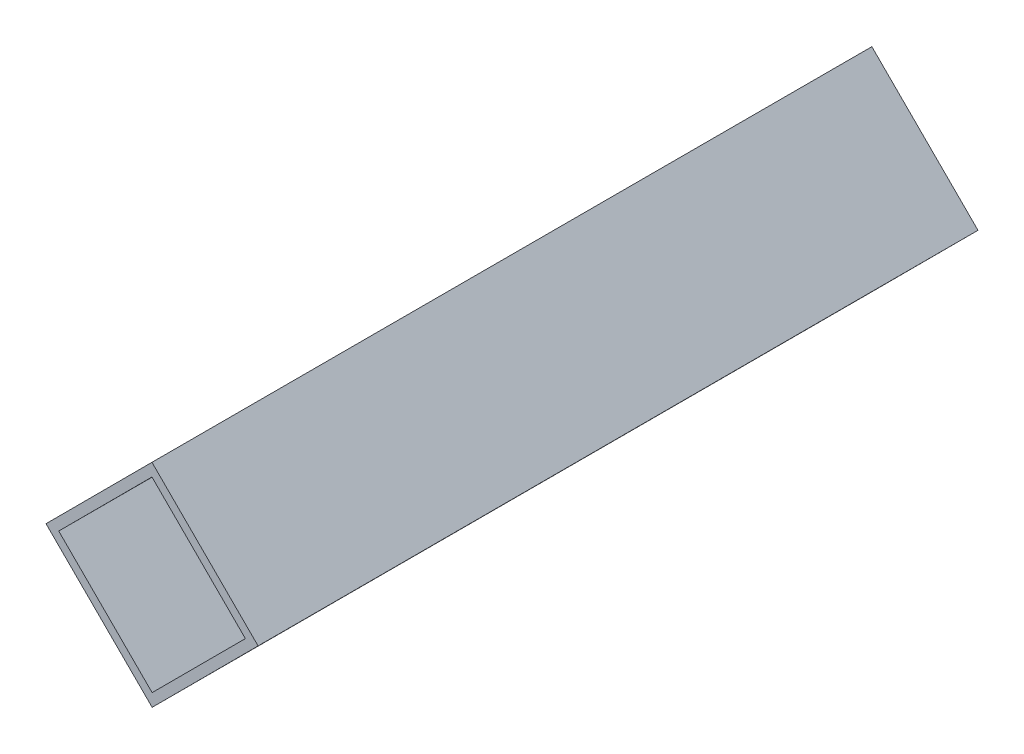
ISO-10303-21;
HEADER;
FILE_DESCRIPTION(('STEP AP214'),'2;1');
FILE_NAME('part.step','',(''),(''),'','','');
FILE_SCHEMA(('AUTOMOTIVE_DESIGN { 1 0 10303 214 1 1 1 1 }'));
ENDSEC;
DATA;
#1=APPLICATION_CONTEXT('core data for automotive mechanical design processes');
#2=APPLICATION_PROTOCOL_DEFINITION('international standard','automotive_design',2000,#1);
#3=PRODUCT_CONTEXT('',#1,'mechanical');
#4=PRODUCT('Part','Part','',(#3));
#5=PRODUCT_RELATED_PRODUCT_CATEGORY('part','',(#4));
#6=PRODUCT_DEFINITION_FORMATION('','',#4);
#7=PRODUCT_DEFINITION_CONTEXT('part definition',#1,'design');
#8=PRODUCT_DEFINITION('design','',#6,#7);
#9=PRODUCT_DEFINITION_SHAPE('','',#8);
#10=(LENGTH_UNIT() NAMED_UNIT(*) SI_UNIT(.MILLI.,.METRE.));
#11=(NAMED_UNIT(*) PLANE_ANGLE_UNIT() SI_UNIT($,.RADIAN.));
#12=(NAMED_UNIT(*) SI_UNIT($,.STERADIAN.) SOLID_ANGLE_UNIT());
#13=UNCERTAINTY_MEASURE_WITH_UNIT(LENGTH_MEASURE(1.E-05),#10,'distance_accuracy_value','');
#14=(GEOMETRIC_REPRESENTATION_CONTEXT(3) GLOBAL_UNCERTAINTY_ASSIGNED_CONTEXT((#13)) GLOBAL_UNIT_ASSIGNED_CONTEXT((#10,
#11,#12)) REPRESENTATION_CONTEXT('',''));
#15=CARTESIAN_POINT('',(0.,0.,0.));
#16=DIRECTION('',(0.,0.,1.));
#17=DIRECTION('',(1.,0.,0.));
#18=AXIS2_PLACEMENT_3D('',#15,#16,#17);
#19=CARTESIAN_POINT('',(0.,0.,120.));
#20=DIRECTION('',(0.,0.,1.));
#21=DIRECTION('',(1.,0.,0.));
#22=AXIS2_PLACEMENT_3D('',#19,#20,#21);
#23=PLANE('',#22);
#24=DIRECTION('',(-0.70646122875546,-0.707751744798503,0.));
#25=VECTOR('',#24,1.);
#26=CARTESIAN_POINT('',(0.,0.,120.));
#27=LINE('',#26,#25);
#28=CARTESIAN_POINT('',(0.,0.,120.));
#29=VERTEX_POINT('',#28);
#30=CARTESIAN_POINT('',(-17.6615307188865,-17.6937936199626,120.));
#31=VERTEX_POINT('',#30);
#32=EDGE_CURVE('E153',#29,#31,#27,.T.);
#33=ORIENTED_EDGE('',*,*,#32,.T.);
#34=DIRECTION('',(0.707751744798503,-0.70646122875546,0.));
#35=VECTOR('',#34,1.);
#36=CARTESIAN_POINT('',(-17.6615307188865,-17.6937936199626,120.));
#37=LINE('',#36,#35);
#38=CARTESIAN_POINT('',(0.0322629010760627,-35.3553243388491,120.));
#39=VERTEX_POINT('',#38);
#40=EDGE_CURVE('E157',#31,#39,#37,.T.);
#41=ORIENTED_EDGE('',*,*,#40,.T.);
#42=DIRECTION('',(0.70646122875546,0.707751744798503,0.));
#43=VECTOR('',#42,1.);
#44=CARTESIAN_POINT('',(17.6937936199626,-17.6615307188865,120.));
#45=LINE('',#44,#43);
#46=CARTESIAN_POINT('',(17.6937936199626,-17.6615307188865,120.));
#47=VERTEX_POINT('',#46);
#48=EDGE_CURVE('E161',#39,#47,#45,.T.);
#49=ORIENTED_EDGE('',*,*,#48,.T.);
#50=DIRECTION('',(-0.707751744798503,0.70646122875546,0.));
#51=VECTOR('',#50,1.);
#52=CARTESIAN_POINT('',(0.,0.,120.));
#53=LINE('',#52,#51);
#54=EDGE_CURVE('E164',#47,#29,#53,.T.);
#55=ORIENTED_EDGE('',*,*,#54,.T.);
#56=EDGE_LOOP('',(#33,#41,#49,#55));
#57=FACE_BOUND('',#56,.T.);
#58=DIRECTION('',(-0.706461228755461,-0.707751744798503,0.));
#59=VECTOR('',#58,1.);
#60=CARTESIAN_POINT('',(0.00193577406456353,-2.12131946033095,120.));
#61=LINE('',#60,#59);
#62=CARTESIAN_POINT('',(0.00193577406456353,-2.12131946033095,120.));
#63=VERTEX_POINT('',#62);
#64=CARTESIAN_POINT('',(-15.5402112585556,-17.691857845898,120.));
#65=VERTEX_POINT('',#64);
#66=EDGE_CURVE('E114',#63,#65,#61,.T.);
#67=ORIENTED_EDGE('',*,*,#66,.F.);
#68=DIRECTION('',(-0.707751744798503,0.70646122875546,0.));
#69=VECTOR('',#68,1.);
#70=CARTESIAN_POINT('',(0.00193577406456353,-2.12131946033095,120.));
#71=LINE('',#70,#69);
#72=CARTESIAN_POINT('',(15.5724741596316,-17.6634664929511,120.));
#73=VERTEX_POINT('',#72);
#74=EDGE_CURVE('E105',#73,#63,#71,.T.);
#75=ORIENTED_EDGE('',*,*,#74,.F.);
#76=DIRECTION('',(0.70646122875546,0.707751744798503,0.));
#77=VECTOR('',#76,1.);
#78=CARTESIAN_POINT('',(15.5724741596316,-17.6634664929511,120.));
#79=LINE('',#78,#77);
#80=CARTESIAN_POINT('',(0.0303271270114952,-33.2340048785181,120.));
#81=VERTEX_POINT('',#80);
#82=EDGE_CURVE('E131',#81,#73,#79,.T.);
#83=ORIENTED_EDGE('',*,*,#82,.F.);
#84=DIRECTION('',(0.707751744798503,-0.70646122875546,0.));
#85=VECTOR('',#84,1.);
#86=CARTESIAN_POINT('',(-15.5402112585556,-17.691857845898,120.));
#87=LINE('',#86,#85);
#88=EDGE_CURVE('E127',#65,#81,#87,.T.);
#89=ORIENTED_EDGE('',*,*,#88,.F.);
#90=EDGE_LOOP('',(#67,#75,#83,#89));
#91=FACE_BOUND('',#90,.T.);
#92=ADVANCED_FACE('F39',(#57,#91),#23,.T.);
#93=CARTESIAN_POINT('',(0.,0.,0.));
#94=DIRECTION('',(0.,0.,1.));
#95=DIRECTION('',(1.,0.,0.));
#96=AXIS2_PLACEMENT_3D('',#93,#94,#95);
#97=PLANE('',#96);
#98=DIRECTION('',(-0.70646122875546,-0.707751744798503,0.));
#99=VECTOR('',#98,1.);
#100=CARTESIAN_POINT('',(0.,0.,0.));
#101=LINE('',#100,#99);
#102=CARTESIAN_POINT('',(0.,0.,0.));
#103=VERTEX_POINT('',#102);
#104=CARTESIAN_POINT('',(-17.6615307188865,-17.6937936199626,0.));
#105=VERTEX_POINT('',#104);
#106=EDGE_CURVE('E123',#103,#105,#101,.T.);
#107=ORIENTED_EDGE('',*,*,#106,.F.);
#108=DIRECTION('',(-0.707751744798503,0.70646122875546,0.));
#109=VECTOR('',#108,1.);
#110=CARTESIAN_POINT('',(0.,0.,0.));
#111=LINE('',#110,#109);
#112=CARTESIAN_POINT('',(17.6937936199626,-17.6615307188865,0.));
#113=VERTEX_POINT('',#112);
#114=EDGE_CURVE('E158',#113,#103,#111,.T.);
#115=ORIENTED_EDGE('',*,*,#114,.F.);
#116=DIRECTION('',(0.70646122875546,0.707751744798503,0.));
#117=VECTOR('',#116,1.);
#118=CARTESIAN_POINT('',(17.6937936199626,-17.6615307188865,0.));
#119=LINE('',#118,#117);
#120=CARTESIAN_POINT('',(0.0322629010760627,-35.3553243388491,0.));
#121=VERTEX_POINT('',#120);
#122=EDGE_CURVE('E174',#121,#113,#119,.T.);
#123=ORIENTED_EDGE('',*,*,#122,.F.);
#124=DIRECTION('',(0.707751744798503,-0.70646122875546,0.));
#125=VECTOR('',#124,1.);
#126=CARTESIAN_POINT('',(-17.6615307188865,-17.6937936199626,0.));
#127=LINE('',#126,#125);
#128=EDGE_CURVE('E171',#105,#121,#127,.T.);
#129=ORIENTED_EDGE('',*,*,#128,.F.);
#130=EDGE_LOOP('',(#107,#115,#123,#129));
#131=FACE_BOUND('',#130,.T.);
#132=DIRECTION('',(-0.707751744798503,0.70646122875546,0.));
#133=VECTOR('',#132,1.);
#134=CARTESIAN_POINT('',(0.00193577406456353,-2.12131946033095,0.));
#135=LINE('',#134,#133);
#136=CARTESIAN_POINT('',(15.5724741596316,-17.6634664929511,0.));
#137=VERTEX_POINT('',#136);
#138=CARTESIAN_POINT('',(0.00193577406456353,-2.12131946033095,0.));
#139=VERTEX_POINT('',#138);
#140=EDGE_CURVE('E63',#137,#139,#135,.T.);
#141=ORIENTED_EDGE('',*,*,#140,.T.);
#142=DIRECTION('',(-0.706461228755461,-0.707751744798503,0.));
#143=VECTOR('',#142,1.);
#144=CARTESIAN_POINT('',(0.00193577406456353,-2.12131946033095,0.));
#145=LINE('',#144,#143);
#146=CARTESIAN_POINT('',(-15.5402112585556,-17.691857845898,0.));
#147=VERTEX_POINT('',#146);
#148=EDGE_CURVE('E121',#139,#147,#145,.T.);
#149=ORIENTED_EDGE('',*,*,#148,.T.);
#150=DIRECTION('',(0.707751744798503,-0.70646122875546,0.));
#151=VECTOR('',#150,1.);
#152=CARTESIAN_POINT('',(-15.5402112585556,-17.691857845898,0.));
#153=LINE('',#152,#151);
#154=CARTESIAN_POINT('',(0.0303271270114987,-33.2340048785181,0.));
#155=VERTEX_POINT('',#154);
#156=EDGE_CURVE('E140',#147,#155,#153,.T.);
#157=ORIENTED_EDGE('',*,*,#156,.T.);
#158=DIRECTION('',(0.70646122875546,0.707751744798503,0.));
#159=VECTOR('',#158,1.);
#160=CARTESIAN_POINT('',(15.5724741596316,-17.6634664929511,0.));
#161=LINE('',#160,#159);
#162=EDGE_CURVE('E115',#155,#137,#161,.T.);
#163=ORIENTED_EDGE('',*,*,#162,.T.);
#164=EDGE_LOOP('',(#141,#149,#157,#163));
#165=FACE_BOUND('',#164,.T.);
#166=ADVANCED_FACE('F197',(#131,#165),#97,.F.);
#167=CARTESIAN_POINT('',(0.,0.,120.));
#168=DIRECTION('',(0.707751744798503,-0.70646122875546,0.));
#169=DIRECTION('',(0.70646122875546,0.707751744798503,0.));
#170=AXIS2_PLACEMENT_3D('',#167,#168,#169);
#171=PLANE('',#170);
#172=ORIENTED_EDGE('',*,*,#106,.T.);
#173=DIRECTION('',(0.,0.,-1.));
#174=VECTOR('',#173,1.);
#175=CARTESIAN_POINT('',(-17.6615307188865,-17.6937936199626,120.));
#176=LINE('',#175,#174);
#177=EDGE_CURVE('E11',#31,#105,#176,.T.);
#178=ORIENTED_EDGE('',*,*,#177,.F.);
#179=ORIENTED_EDGE('',*,*,#32,.F.);
#180=DIRECTION('',(0.,0.,-1.));
#181=VECTOR('',#180,1.);
#182=CARTESIAN_POINT('',(0.,0.,120.));
#183=LINE('',#182,#181);
#184=EDGE_CURVE('E167',#29,#103,#183,.T.);
#185=ORIENTED_EDGE('',*,*,#184,.T.);
#186=EDGE_LOOP('',(#172,#178,#179,#185));
#187=FACE_BOUND('',#186,.T.);
#188=ADVANCED_FACE('F41',(#187),#171,.F.);
#189=CARTESIAN_POINT('',(-17.6615307188865,-17.6937936199626,120.));
#190=DIRECTION('',(0.70646122875546,0.707751744798503,0.));
#191=DIRECTION('',(-0.707751744798503,0.70646122875546,0.));
#192=AXIS2_PLACEMENT_3D('',#189,#190,#191);
#193=PLANE('',#192);
#194=ORIENTED_EDGE('',*,*,#128,.T.);
#195=DIRECTION('',(0.,0.,-1.));
#196=VECTOR('',#195,1.);
#197=CARTESIAN_POINT('',(0.0322629010760627,-35.3553243388491,120.));
#198=LINE('',#197,#196);
#199=EDGE_CURVE('E48',#39,#121,#198,.T.);
#200=ORIENTED_EDGE('',*,*,#199,.F.);
#201=ORIENTED_EDGE('',*,*,#40,.F.);
#202=ORIENTED_EDGE('',*,*,#177,.T.);
#203=EDGE_LOOP('',(#194,#200,#201,#202));
#204=FACE_BOUND('',#203,.T.);
#205=ADVANCED_FACE('F207',(#204),#193,.F.);
#206=CARTESIAN_POINT('',(17.6937936199626,-17.6615307188865,120.));
#207=DIRECTION('',(-0.707751744798503,0.70646122875546,0.));
#208=DIRECTION('',(-0.70646122875546,-0.707751744798503,0.));
#209=AXIS2_PLACEMENT_3D('',#206,#207,#208);
#210=PLANE('',#209);
#211=ORIENTED_EDGE('',*,*,#122,.T.);
#212=DIRECTION('',(0.,0.,-1.));
#213=VECTOR('',#212,1.);
#214=CARTESIAN_POINT('',(17.6937936199626,-17.6615307188865,120.));
#215=LINE('',#214,#213);
#216=EDGE_CURVE('E182',#47,#113,#215,.T.);
#217=ORIENTED_EDGE('',*,*,#216,.F.);
#218=ORIENTED_EDGE('',*,*,#48,.F.);
#219=ORIENTED_EDGE('',*,*,#199,.T.);
#220=EDGE_LOOP('',(#211,#217,#218,#219));
#221=FACE_BOUND('',#220,.T.);
#222=ADVANCED_FACE('F191',(#221),#210,.F.);
#223=CARTESIAN_POINT('',(0.,0.,120.));
#224=DIRECTION('',(-0.70646122875546,-0.707751744798503,0.));
#225=DIRECTION('',(0.707751744798503,-0.70646122875546,0.));
#226=AXIS2_PLACEMENT_3D('',#223,#224,#225);
#227=PLANE('',#226);
#228=ORIENTED_EDGE('',*,*,#114,.T.);
#229=ORIENTED_EDGE('',*,*,#184,.F.);
#230=ORIENTED_EDGE('',*,*,#54,.F.);
#231=ORIENTED_EDGE('',*,*,#216,.T.);
#232=EDGE_LOOP('',(#228,#229,#230,#231));
#233=FACE_BOUND('',#232,.T.);
#234=ADVANCED_FACE('F201',(#233),#227,.F.);
#235=CARTESIAN_POINT('',(0.00193577406456353,-2.12131946033095,120.));
#236=DIRECTION('',(-0.70646122875546,-0.707751744798503,0.));
#237=DIRECTION('',(0.707751744798503,-0.70646122875546,0.));
#238=AXIS2_PLACEMENT_3D('',#235,#236,#237);
#239=PLANE('',#238);
#240=ORIENTED_EDGE('',*,*,#140,.F.);
#241=DIRECTION('',(0.,0.,-1.));
#242=VECTOR('',#241,1.);
#243=CARTESIAN_POINT('',(15.5724741596316,-17.6634664929511,120.));
#244=LINE('',#243,#242);
#245=EDGE_CURVE('E109',#73,#137,#244,.T.);
#246=ORIENTED_EDGE('',*,*,#245,.F.);
#247=ORIENTED_EDGE('',*,*,#74,.T.);
#248=DIRECTION('',(0.,0.,-1.));
#249=VECTOR('',#248,1.);
#250=CARTESIAN_POINT('',(0.00193577406456353,-2.12131946033095,120.));
#251=LINE('',#250,#249);
#252=EDGE_CURVE('E108',#63,#139,#251,.T.);
#253=ORIENTED_EDGE('',*,*,#252,.T.);
#254=EDGE_LOOP('',(#240,#246,#247,#253));
#255=FACE_BOUND('',#254,.T.);
#256=ADVANCED_FACE('F107',(#255),#239,.T.);
#257=CARTESIAN_POINT('',(0.00193577406456353,-2.12131946033095,120.));
#258=DIRECTION('',(0.707751744798503,-0.706461228755461,0.));
#259=DIRECTION('',(0.706461228755461,0.707751744798503,0.));
#260=AXIS2_PLACEMENT_3D('',#257,#258,#259);
#261=PLANE('',#260);
#262=ORIENTED_EDGE('',*,*,#148,.F.);
#263=ORIENTED_EDGE('',*,*,#252,.F.);
#264=ORIENTED_EDGE('',*,*,#66,.T.);
#265=DIRECTION('',(0.,0.,-1.));
#266=VECTOR('',#265,1.);
#267=CARTESIAN_POINT('',(-15.5402112585556,-17.691857845898,120.));
#268=LINE('',#267,#266);
#269=EDGE_CURVE('E124',#65,#147,#268,.T.);
#270=ORIENTED_EDGE('',*,*,#269,.T.);
#271=EDGE_LOOP('',(#262,#263,#264,#270));
#272=FACE_BOUND('',#271,.T.);
#273=ADVANCED_FACE('F118',(#272),#261,.T.);
#274=CARTESIAN_POINT('',(-15.5402112585556,-17.691857845898,120.));
#275=DIRECTION('',(0.70646122875546,0.707751744798503,0.));
#276=DIRECTION('',(-0.707751744798503,0.70646122875546,0.));
#277=AXIS2_PLACEMENT_3D('',#274,#275,#276);
#278=PLANE('',#277);
#279=ORIENTED_EDGE('',*,*,#156,.F.);
#280=ORIENTED_EDGE('',*,*,#269,.F.);
#281=ORIENTED_EDGE('',*,*,#88,.T.);
#282=DIRECTION('',(0.,0.,-1.));
#283=VECTOR('',#282,1.);
#284=CARTESIAN_POINT('',(0.0303271270114987,-33.2340048785181,120.));
#285=LINE('',#284,#283);
#286=EDGE_CURVE('E55',#81,#155,#285,.T.);
#287=ORIENTED_EDGE('',*,*,#286,.T.);
#288=EDGE_LOOP('',(#279,#280,#281,#287));
#289=FACE_BOUND('',#288,.T.);
#290=ADVANCED_FACE('F230',(#289),#278,.T.);
#291=CARTESIAN_POINT('',(15.5724741596316,-17.6634664929511,120.));
#292=DIRECTION('',(-0.707751744798503,0.70646122875546,0.));
#293=DIRECTION('',(-0.70646122875546,-0.707751744798503,0.));
#294=AXIS2_PLACEMENT_3D('',#291,#292,#293);
#295=PLANE('',#294);
#296=ORIENTED_EDGE('',*,*,#162,.F.);
#297=ORIENTED_EDGE('',*,*,#286,.F.);
#298=ORIENTED_EDGE('',*,*,#82,.T.);
#299=ORIENTED_EDGE('',*,*,#245,.T.);
#300=EDGE_LOOP('',(#296,#297,#298,#299));
#301=FACE_BOUND('',#300,.T.);
#302=ADVANCED_FACE('F234',(#301),#295,.T.);
#303=CLOSED_SHELL('',(#92,#166,#188,#205,#222,#234,#256,#273,#290,#302));
#304=MANIFOLD_SOLID_BREP('B2',#303);
#305=ADVANCED_BREP_SHAPE_REPRESENTATION('',(#18,#304),#14);
#306=SHAPE_DEFINITION_REPRESENTATION(#9,#305);
ENDSEC;
END-ISO-10303-21;
